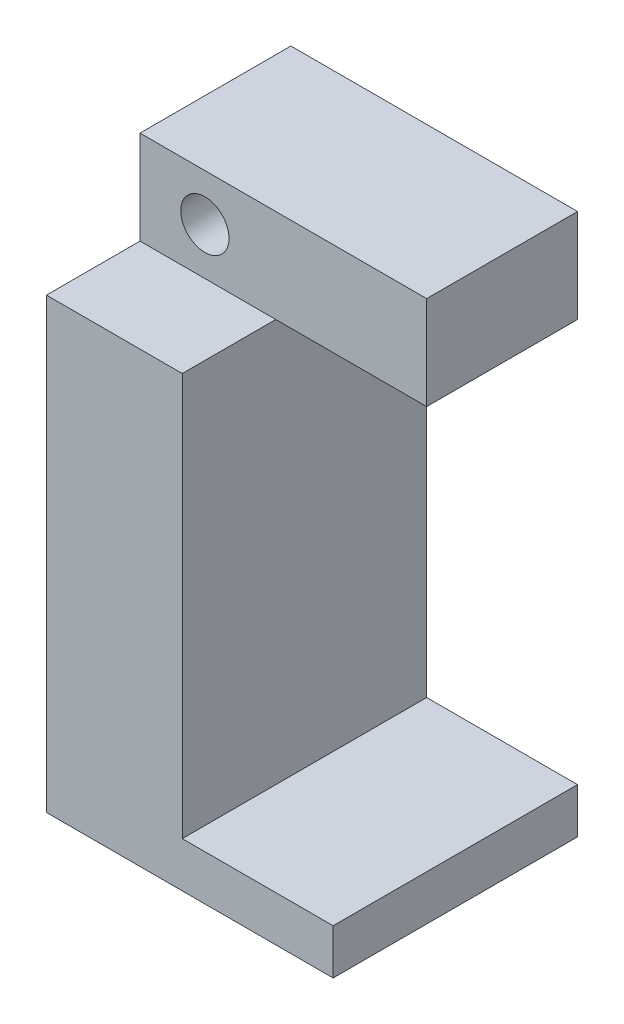
ISO-10303-21;
HEADER;
FILE_DESCRIPTION(('STEP AP214'),'2;1');
FILE_NAME('part.step','',(''),(''),'','','');
FILE_SCHEMA(('AUTOMOTIVE_DESIGN { 1 0 10303 214 1 1 1 1 }'));
ENDSEC;
DATA;
#1=APPLICATION_CONTEXT('core data for automotive mechanical design processes');
#2=APPLICATION_PROTOCOL_DEFINITION('international standard','automotive_design',2000,#1);
#3=PRODUCT_CONTEXT('',#1,'mechanical');
#4=PRODUCT('Part','Part','',(#3));
#5=PRODUCT_RELATED_PRODUCT_CATEGORY('part','',(#4));
#6=PRODUCT_DEFINITION_FORMATION('','',#4);
#7=PRODUCT_DEFINITION_CONTEXT('part definition',#1,'design');
#8=PRODUCT_DEFINITION('design','',#6,#7);
#9=PRODUCT_DEFINITION_SHAPE('','',#8);
#10=(LENGTH_UNIT() NAMED_UNIT(*) SI_UNIT(.MILLI.,.METRE.));
#11=(NAMED_UNIT(*) PLANE_ANGLE_UNIT() SI_UNIT($,.RADIAN.));
#12=(NAMED_UNIT(*) SI_UNIT($,.STERADIAN.) SOLID_ANGLE_UNIT());
#13=UNCERTAINTY_MEASURE_WITH_UNIT(LENGTH_MEASURE(1.E-05),#10,'distance_accuracy_value','');
#14=(GEOMETRIC_REPRESENTATION_CONTEXT(3) GLOBAL_UNCERTAINTY_ASSIGNED_CONTEXT((#13)) GLOBAL_UNIT_ASSIGNED_CONTEXT((#10,
#11,#12)) REPRESENTATION_CONTEXT('',''));
#15=CARTESIAN_POINT('',(0.,0.,0.));
#16=DIRECTION('',(0.,0.,1.));
#17=DIRECTION('',(1.,0.,0.));
#18=AXIS2_PLACEMENT_3D('',#15,#16,#17);
#19=CARTESIAN_POINT('',(4.29999999999999,32.8,-0.000999999999999265));
#20=DIRECTION('',(0.,0.,1.));
#21=DIRECTION('',(1.,0.,0.));
#22=AXIS2_PLACEMENT_3D('',#19,#20,#21);
#23=CYLINDRICAL_SURFACE('',#22,1.6);
#24=CARTESIAN_POINT('',(4.29999999999999,32.8,10.));
#25=DIRECTION('',(0.,0.,1.));
#26=DIRECTION('',(1.,0.,0.));
#27=AXIS2_PLACEMENT_3D('',#24,#25,#26);
#28=CIRCLE('',#27,1.6);
#29=CARTESIAN_POINT('',(5.89999999999999,32.8,10.));
#30=VERTEX_POINT('',#29);
#31=EDGE_CURVE('E206',#30,#30,#28,.T.);
#32=ORIENTED_EDGE('',*,*,#31,.T.);
#33=EDGE_LOOP('',(#32));
#34=FACE_BOUND('',#33,.T.);
#35=CARTESIAN_POINT('',(4.29999999999999,32.8,3.));
#36=DIRECTION('',(0.,0.,-1.));
#37=DIRECTION('',(-1.,0.,0.));
#38=AXIS2_PLACEMENT_3D('',#35,#36,#37);
#39=CIRCLE('',#38,1.6);
#40=CARTESIAN_POINT('',(2.69999999999999,32.8,3.));
#41=VERTEX_POINT('',#40);
#42=EDGE_CURVE('E35',#41,#41,#39,.F.);
#43=ORIENTED_EDGE('',*,*,#42,.F.);
#44=EDGE_LOOP('',(#43));
#45=FACE_BOUND('',#44,.T.);
#46=ADVANCED_FACE('F31',(#34,#45),#23,.F.);
#47=CARTESIAN_POINT('',(0.,35.9,10.));
#48=DIRECTION('',(1.,0.,0.));
#49=DIRECTION('',(0.,0.,-1.));
#50=AXIS2_PLACEMENT_3D('',#47,#48,#49);
#51=PLANE('',#50);
#52=DIRECTION('',(0.,-1.,0.));
#53=VECTOR('',#52,1.);
#54=CARTESIAN_POINT('',(0.,35.9,0.));
#55=LINE('',#54,#53);
#56=CARTESIAN_POINT('',(0.,35.9,0.));
#57=VERTEX_POINT('',#56);
#58=CARTESIAN_POINT('',(0.,0.,0.));
#59=VERTEX_POINT('',#58);
#60=EDGE_CURVE('E241',#57,#59,#55,.T.);
#61=ORIENTED_EDGE('',*,*,#60,.T.);
#62=DIRECTION('',(0.,0.,-1.));
#63=VECTOR('',#62,1.);
#64=CARTESIAN_POINT('',(0.,0.,10.));
#65=LINE('',#64,#63);
#66=CARTESIAN_POINT('',(0.,0.,16.2));
#67=VERTEX_POINT('',#66);
#68=EDGE_CURVE('E11',#67,#59,#65,.T.);
#69=ORIENTED_EDGE('',*,*,#68,.F.);
#70=DIRECTION('',(0.,-1.,0.));
#71=VECTOR('',#70,1.);
#72=CARTESIAN_POINT('',(0.,29.7,16.2));
#73=LINE('',#72,#71);
#74=CARTESIAN_POINT('',(0.,29.7,16.2));
#75=VERTEX_POINT('',#74);
#76=EDGE_CURVE('E222',#75,#67,#73,.T.);
#77=ORIENTED_EDGE('',*,*,#76,.F.);
#78=DIRECTION('',(0.,0.,-1.));
#79=VECTOR('',#78,1.);
#80=CARTESIAN_POINT('',(0.,29.7,16.2));
#81=LINE('',#80,#79);
#82=CARTESIAN_POINT('',(0.,29.7,10.));
#83=VERTEX_POINT('',#82);
#84=EDGE_CURVE('E225',#75,#83,#81,.T.);
#85=ORIENTED_EDGE('',*,*,#84,.T.);
#86=DIRECTION('',(0.,-1.,0.));
#87=VECTOR('',#86,1.);
#88=CARTESIAN_POINT('',(0.,35.9,10.));
#89=LINE('',#88,#87);
#90=CARTESIAN_POINT('',(0.,35.9,10.));
#91=VERTEX_POINT('',#90);
#92=EDGE_CURVE('E233',#91,#83,#89,.T.);
#93=ORIENTED_EDGE('',*,*,#92,.F.);
#94=DIRECTION('',(0.,0.,-1.));
#95=VECTOR('',#94,1.);
#96=CARTESIAN_POINT('',(0.,35.9,10.));
#97=LINE('',#96,#95);
#98=EDGE_CURVE('E264',#91,#57,#97,.T.);
#99=ORIENTED_EDGE('',*,*,#98,.T.);
#100=EDGE_LOOP('',(#61,#69,#77,#85,#93,#99));
#101=FACE_BOUND('',#100,.T.);
#102=ADVANCED_FACE('F33',(#101),#51,.F.);
#103=CARTESIAN_POINT('',(0.,0.,10.));
#104=DIRECTION('',(0.,1.,0.));
#105=DIRECTION('',(0.,0.,1.));
#106=AXIS2_PLACEMENT_3D('',#103,#104,#105);
#107=PLANE('',#106);
#108=DIRECTION('',(1.,0.,0.));
#109=VECTOR('',#108,1.);
#110=CARTESIAN_POINT('',(0.,0.,0.));
#111=LINE('',#110,#109);
#112=CARTESIAN_POINT('',(19.,0.,0.));
#113=VERTEX_POINT('',#112);
#114=EDGE_CURVE('E246',#59,#113,#111,.T.);
#115=ORIENTED_EDGE('',*,*,#114,.T.);
#116=DIRECTION('',(0.,0.,-1.));
#117=VECTOR('',#116,1.);
#118=CARTESIAN_POINT('',(19.,0.,10.));
#119=LINE('',#118,#117);
#120=CARTESIAN_POINT('',(19.,0.,16.2));
#121=VERTEX_POINT('',#120);
#122=EDGE_CURVE('E40',#121,#113,#119,.T.);
#123=ORIENTED_EDGE('',*,*,#122,.F.);
#124=DIRECTION('',(1.,0.,0.));
#125=VECTOR('',#124,1.);
#126=CARTESIAN_POINT('',(0.,0.,16.2));
#127=LINE('',#126,#125);
#128=EDGE_CURVE('E209',#67,#121,#127,.T.);
#129=ORIENTED_EDGE('',*,*,#128,.F.);
#130=ORIENTED_EDGE('',*,*,#68,.T.);
#131=EDGE_LOOP('',(#115,#123,#129,#130));
#132=FACE_BOUND('',#131,.T.);
#133=ADVANCED_FACE('F300',(#132),#107,.F.);
#134=CARTESIAN_POINT('',(19.,0.,10.));
#135=DIRECTION('',(-1.,0.,0.));
#136=DIRECTION('',(0.,0.,1.));
#137=AXIS2_PLACEMENT_3D('',#134,#135,#136);
#138=PLANE('',#137);
#139=DIRECTION('',(0.,1.,0.));
#140=VECTOR('',#139,1.);
#141=CARTESIAN_POINT('',(19.,0.,0.));
#142=LINE('',#141,#140);
#143=CARTESIAN_POINT('',(19.,3.,0.));
#144=VERTEX_POINT('',#143);
#145=EDGE_CURVE('E249',#113,#144,#142,.T.);
#146=ORIENTED_EDGE('',*,*,#145,.T.);
#147=DIRECTION('',(0.,0.,-1.));
#148=VECTOR('',#147,1.);
#149=CARTESIAN_POINT('',(19.,3.,10.));
#150=LINE('',#149,#148);
#151=CARTESIAN_POINT('',(19.,3.,16.2));
#152=VERTEX_POINT('',#151);
#153=EDGE_CURVE('E277',#152,#144,#150,.T.);
#154=ORIENTED_EDGE('',*,*,#153,.F.);
#155=DIRECTION('',(0.,1.,0.));
#156=VECTOR('',#155,1.);
#157=CARTESIAN_POINT('',(19.,0.,16.2));
#158=LINE('',#157,#156);
#159=EDGE_CURVE('E212',#121,#152,#158,.T.);
#160=ORIENTED_EDGE('',*,*,#159,.F.);
#161=ORIENTED_EDGE('',*,*,#122,.T.);
#162=EDGE_LOOP('',(#146,#154,#160,#161));
#163=FACE_BOUND('',#162,.T.);
#164=ADVANCED_FACE('F284',(#163),#138,.F.);
#165=CARTESIAN_POINT('',(19.,3.,10.));
#166=DIRECTION('',(0.,-1.,0.));
#167=DIRECTION('',(1.,0.,0.));
#168=AXIS2_PLACEMENT_3D('',#165,#166,#167);
#169=PLANE('',#168);
#170=DIRECTION('',(-1.,0.,0.));
#171=VECTOR('',#170,1.);
#172=CARTESIAN_POINT('',(19.,3.,0.));
#173=LINE('',#172,#171);
#174=CARTESIAN_POINT('',(9.,2.99999999999999,0.));
#175=VERTEX_POINT('',#174);
#176=EDGE_CURVE('E255',#144,#175,#173,.T.);
#177=ORIENTED_EDGE('',*,*,#176,.T.);
#178=DIRECTION('',(0.,0.,-1.));
#179=VECTOR('',#178,1.);
#180=CARTESIAN_POINT('',(9.,2.99999999999999,10.));
#181=LINE('',#180,#179);
#182=CARTESIAN_POINT('',(9.,2.99999999999999,16.2));
#183=VERTEX_POINT('',#182);
#184=EDGE_CURVE('E274',#183,#175,#181,.T.);
#185=ORIENTED_EDGE('',*,*,#184,.F.);
#186=DIRECTION('',(-1.,0.,0.));
#187=VECTOR('',#186,1.);
#188=CARTESIAN_POINT('',(19.,3.,16.2));
#189=LINE('',#188,#187);
#190=EDGE_CURVE('E215',#152,#183,#189,.T.);
#191=ORIENTED_EDGE('',*,*,#190,.F.);
#192=ORIENTED_EDGE('',*,*,#153,.T.);
#193=EDGE_LOOP('',(#177,#185,#191,#192));
#194=FACE_BOUND('',#193,.T.);
#195=ADVANCED_FACE('F293',(#194),#169,.F.);
#196=CARTESIAN_POINT('',(9.,2.99999999999999,10.));
#197=DIRECTION('',(-1.,0.,0.));
#198=DIRECTION('',(0.,-1.,0.));
#199=AXIS2_PLACEMENT_3D('',#196,#197,#198);
#200=PLANE('',#199);
#201=DIRECTION('',(0.,1.,0.));
#202=VECTOR('',#201,1.);
#203=CARTESIAN_POINT('',(9.,2.99999999999999,0.));
#204=LINE('',#203,#202);
#205=CARTESIAN_POINT('',(8.99999999999999,29.7,0.));
#206=VERTEX_POINT('',#205);
#207=EDGE_CURVE('E257',#175,#206,#204,.T.);
#208=ORIENTED_EDGE('',*,*,#207,.T.);
#209=DIRECTION('',(0.,0.,-1.));
#210=VECTOR('',#209,1.);
#211=CARTESIAN_POINT('',(8.99999999999999,29.7,10.));
#212=LINE('',#211,#210);
#213=CARTESIAN_POINT('',(8.99999999999999,29.7,10.));
#214=VERTEX_POINT('',#213);
#215=EDGE_CURVE('E271',#214,#206,#212,.T.);
#216=ORIENTED_EDGE('',*,*,#215,.F.);
#217=DIRECTION('',(0.,0.,-1.));
#218=VECTOR('',#217,1.);
#219=CARTESIAN_POINT('',(8.99999999999999,29.7,16.2));
#220=LINE('',#219,#218);
#221=CARTESIAN_POINT('',(8.99999999999999,29.7,16.2));
#222=VERTEX_POINT('',#221);
#223=EDGE_CURVE('E228',#222,#214,#220,.T.);
#224=ORIENTED_EDGE('',*,*,#223,.F.);
#225=DIRECTION('',(0.,1.,0.));
#226=VECTOR('',#225,1.);
#227=CARTESIAN_POINT('',(9.,2.99999999999999,16.2));
#228=LINE('',#227,#226);
#229=EDGE_CURVE('E218',#183,#222,#228,.T.);
#230=ORIENTED_EDGE('',*,*,#229,.F.);
#231=ORIENTED_EDGE('',*,*,#184,.T.);
#232=EDGE_LOOP('',(#208,#216,#224,#230,#231));
#233=FACE_BOUND('',#232,.T.);
#234=ADVANCED_FACE('F297',(#233),#200,.F.);
#235=CARTESIAN_POINT('',(8.99999999999999,29.7,10.));
#236=DIRECTION('',(0.,1.,0.));
#237=DIRECTION('',(0.,0.,1.));
#238=AXIS2_PLACEMENT_3D('',#235,#236,#237);
#239=PLANE('',#238);
#240=DIRECTION('',(1.,0.,0.));
#241=VECTOR('',#240,1.);
#242=CARTESIAN_POINT('',(8.99999999999999,29.7,0.));
#243=LINE('',#242,#241);
#244=CARTESIAN_POINT('',(19.,29.7,0.));
#245=VERTEX_POINT('',#244);
#246=EDGE_CURVE('E259',#206,#245,#243,.T.);
#247=ORIENTED_EDGE('',*,*,#246,.T.);
#248=DIRECTION('',(0.,0.,-1.));
#249=VECTOR('',#248,1.);
#250=CARTESIAN_POINT('',(19.,29.7,10.));
#251=LINE('',#250,#249);
#252=CARTESIAN_POINT('',(19.,29.7,10.));
#253=VERTEX_POINT('',#252);
#254=EDGE_CURVE('E268',#253,#245,#251,.T.);
#255=ORIENTED_EDGE('',*,*,#254,.F.);
#256=DIRECTION('',(1.,0.,0.));
#257=VECTOR('',#256,1.);
#258=CARTESIAN_POINT('',(8.99999999999999,29.7,10.));
#259=LINE('',#258,#257);
#260=EDGE_CURVE('E505',#214,#253,#259,.T.);
#261=ORIENTED_EDGE('',*,*,#260,.F.);
#262=ORIENTED_EDGE('',*,*,#215,.T.);
#263=EDGE_LOOP('',(#247,#255,#261,#262));
#264=FACE_BOUND('',#263,.T.);
#265=ADVANCED_FACE('F332',(#264),#239,.F.);
#266=CARTESIAN_POINT('',(19.,29.7,10.));
#267=DIRECTION('',(-1.,0.,0.));
#268=DIRECTION('',(0.,-1.,0.));
#269=AXIS2_PLACEMENT_3D('',#266,#267,#268);
#270=PLANE('',#269);
#271=DIRECTION('',(0.,1.,0.));
#272=VECTOR('',#271,1.);
#273=CARTESIAN_POINT('',(19.,29.7,0.));
#274=LINE('',#273,#272);
#275=CARTESIAN_POINT('',(19.,35.9,0.));
#276=VERTEX_POINT('',#275);
#277=EDGE_CURVE('E261',#245,#276,#274,.T.);
#278=ORIENTED_EDGE('',*,*,#277,.T.);
#279=DIRECTION('',(0.,0.,-1.));
#280=VECTOR('',#279,1.);
#281=CARTESIAN_POINT('',(19.,35.9,10.));
#282=LINE('',#281,#280);
#283=CARTESIAN_POINT('',(19.,35.9,10.));
#284=VERTEX_POINT('',#283);
#285=EDGE_CURVE('E266',#284,#276,#282,.T.);
#286=ORIENTED_EDGE('',*,*,#285,.F.);
#287=DIRECTION('',(0.,1.,0.));
#288=VECTOR('',#287,1.);
#289=CARTESIAN_POINT('',(19.,29.7,10.));
#290=LINE('',#289,#288);
#291=EDGE_CURVE('E504',#253,#284,#290,.T.);
#292=ORIENTED_EDGE('',*,*,#291,.F.);
#293=ORIENTED_EDGE('',*,*,#254,.T.);
#294=EDGE_LOOP('',(#278,#286,#292,#293));
#295=FACE_BOUND('',#294,.T.);
#296=ADVANCED_FACE('F329',(#295),#270,.F.);
#297=CARTESIAN_POINT('',(19.,35.9,10.));
#298=DIRECTION('',(0.,-1.,0.));
#299=DIRECTION('',(0.,0.,-1.));
#300=AXIS2_PLACEMENT_3D('',#297,#298,#299);
#301=PLANE('',#300);
#302=DIRECTION('',(-1.,0.,0.));
#303=VECTOR('',#302,1.);
#304=CARTESIAN_POINT('',(19.,35.9,0.));
#305=LINE('',#304,#303);
#306=EDGE_CURVE('E90',#276,#57,#305,.T.);
#307=ORIENTED_EDGE('',*,*,#306,.T.);
#308=ORIENTED_EDGE('',*,*,#98,.F.);
#309=DIRECTION('',(-1.,0.,0.));
#310=VECTOR('',#309,1.);
#311=CARTESIAN_POINT('',(19.,35.9,10.));
#312=LINE('',#311,#310);
#313=EDGE_CURVE('E57',#284,#91,#312,.T.);
#314=ORIENTED_EDGE('',*,*,#313,.F.);
#315=ORIENTED_EDGE('',*,*,#285,.T.);
#316=EDGE_LOOP('',(#307,#308,#314,#315));
#317=FACE_BOUND('',#316,.T.);
#318=ADVANCED_FACE('F322',(#317),#301,.F.);
#319=CARTESIAN_POINT('',(0.,0.,10.));
#320=DIRECTION('',(0.,0.,1.));
#321=DIRECTION('',(1.,0.,0.));
#322=AXIS2_PLACEMENT_3D('',#319,#320,#321);
#323=PLANE('',#322);
#324=ORIENTED_EDGE('',*,*,#31,.F.);
#325=EDGE_LOOP('',(#324));
#326=FACE_BOUND('',#325,.T.);
#327=DIRECTION('',(-1.,0.,0.));
#328=VECTOR('',#327,1.);
#329=CARTESIAN_POINT('',(8.99999999999999,29.7,10.));
#330=LINE('',#329,#328);
#331=EDGE_CURVE('E96',#214,#83,#330,.T.);
#332=ORIENTED_EDGE('',*,*,#331,.F.);
#333=ORIENTED_EDGE('',*,*,#260,.T.);
#334=ORIENTED_EDGE('',*,*,#291,.T.);
#335=ORIENTED_EDGE('',*,*,#313,.T.);
#336=ORIENTED_EDGE('',*,*,#92,.T.);
#337=EDGE_LOOP('',(#332,#333,#334,#335,#336));
#338=FACE_BOUND('',#337,.T.);
#339=ADVANCED_FACE('F319',(#326,#338),#323,.T.);
#340=CARTESIAN_POINT('',(0.,0.,0.));
#341=DIRECTION('',(0.,0.,1.));
#342=DIRECTION('',(1.,0.,0.));
#343=AXIS2_PLACEMENT_3D('',#340,#341,#342);
#344=PLANE('',#343);
#345=DIRECTION('',(1.,0.,0.));
#346=VECTOR('',#345,1.);
#347=CARTESIAN_POINT('',(2.65455173280956,35.65,0.));
#348=LINE('',#347,#346);
#349=CARTESIAN_POINT('',(2.65455173280956,35.65,0.));
#350=VERTEX_POINT('',#349);
#351=CARTESIAN_POINT('',(5.94544826719043,35.65,0.));
#352=VERTEX_POINT('',#351);
#353=EDGE_CURVE('E187',#350,#352,#348,.T.);
#354=ORIENTED_EDGE('',*,*,#353,.F.);
#355=DIRECTION('',(0.5,0.866025403784438,0.));
#356=VECTOR('',#355,1.);
#357=CARTESIAN_POINT('',(1.00910346561912,32.8,0.));
#358=LINE('',#357,#356);
#359=CARTESIAN_POINT('',(1.00910346561912,32.8,0.));
#360=VERTEX_POINT('',#359);
#361=EDGE_CURVE('E48',#360,#350,#358,.T.);
#362=ORIENTED_EDGE('',*,*,#361,.F.);
#363=DIRECTION('',(-0.5,0.866025403784439,0.));
#364=VECTOR('',#363,1.);
#365=CARTESIAN_POINT('',(2.65455173280955,29.95,0.));
#366=LINE('',#365,#364);
#367=CARTESIAN_POINT('',(2.65455173280955,29.95,0.));
#368=VERTEX_POINT('',#367);
#369=EDGE_CURVE('E173',#368,#360,#366,.T.);
#370=ORIENTED_EDGE('',*,*,#369,.F.);
#371=DIRECTION('',(-1.,0.,0.));
#372=VECTOR('',#371,1.);
#373=CARTESIAN_POINT('',(5.94544826719043,29.95,0.));
#374=LINE('',#373,#372);
#375=CARTESIAN_POINT('',(5.94544826719043,29.95,0.));
#376=VERTEX_POINT('',#375);
#377=EDGE_CURVE('E176',#376,#368,#374,.T.);
#378=ORIENTED_EDGE('',*,*,#377,.F.);
#379=DIRECTION('',(-0.5,-0.866025403784438,0.));
#380=VECTOR('',#379,1.);
#381=CARTESIAN_POINT('',(7.59089653438087,32.8,0.));
#382=LINE('',#381,#380);
#383=CARTESIAN_POINT('',(7.59089653438087,32.8,0.));
#384=VERTEX_POINT('',#383);
#385=EDGE_CURVE('E192',#384,#376,#382,.T.);
#386=ORIENTED_EDGE('',*,*,#385,.F.);
#387=DIRECTION('',(0.5,-0.866025403784439,0.));
#388=VECTOR('',#387,1.);
#389=CARTESIAN_POINT('',(5.94544826719043,35.65,0.));
#390=LINE('',#389,#388);
#391=EDGE_CURVE('E189',#352,#384,#390,.T.);
#392=ORIENTED_EDGE('',*,*,#391,.F.);
#393=EDGE_LOOP('',(#354,#362,#370,#378,#386,#392));
#394=FACE_BOUND('',#393,.T.);
#395=ORIENTED_EDGE('',*,*,#60,.F.);
#396=ORIENTED_EDGE('',*,*,#306,.F.);
#397=ORIENTED_EDGE('',*,*,#277,.F.);
#398=ORIENTED_EDGE('',*,*,#246,.F.);
#399=ORIENTED_EDGE('',*,*,#207,.F.);
#400=ORIENTED_EDGE('',*,*,#176,.F.);
#401=ORIENTED_EDGE('',*,*,#145,.F.);
#402=ORIENTED_EDGE('',*,*,#114,.F.);
#403=EDGE_LOOP('',(#395,#396,#397,#398,#399,#400,#401,#402));
#404=FACE_BOUND('',#403,.T.);
#405=ADVANCED_FACE('F289',(#394,#404),#344,.F.);
#406=CARTESIAN_POINT('',(8.99999999999999,29.7,16.2));
#407=DIRECTION('',(0.,-1.,0.));
#408=DIRECTION('',(0.,0.,-1.));
#409=AXIS2_PLACEMENT_3D('',#406,#407,#408);
#410=PLANE('',#409);
#411=ORIENTED_EDGE('',*,*,#331,.T.);
#412=ORIENTED_EDGE('',*,*,#84,.F.);
#413=DIRECTION('',(-1.,0.,0.));
#414=VECTOR('',#413,1.);
#415=CARTESIAN_POINT('',(8.99999999999999,29.7,16.2));
#416=LINE('',#415,#414);
#417=EDGE_CURVE('E220',#222,#75,#416,.T.);
#418=ORIENTED_EDGE('',*,*,#417,.F.);
#419=ORIENTED_EDGE('',*,*,#223,.T.);
#420=EDGE_LOOP('',(#411,#412,#418,#419));
#421=FACE_BOUND('',#420,.T.);
#422=ADVANCED_FACE('F316',(#421),#410,.F.);
#423=CARTESIAN_POINT('',(19.,0.,16.2));
#424=DIRECTION('',(0.,0.,1.));
#425=DIRECTION('',(1.,0.,0.));
#426=AXIS2_PLACEMENT_3D('',#423,#424,#425);
#427=PLANE('',#426);
#428=ORIENTED_EDGE('',*,*,#128,.T.);
#429=ORIENTED_EDGE('',*,*,#159,.T.);
#430=ORIENTED_EDGE('',*,*,#190,.T.);
#431=ORIENTED_EDGE('',*,*,#229,.T.);
#432=ORIENTED_EDGE('',*,*,#417,.T.);
#433=ORIENTED_EDGE('',*,*,#76,.T.);
#434=EDGE_LOOP('',(#428,#429,#430,#431,#432,#433));
#435=FACE_BOUND('',#434,.T.);
#436=ADVANCED_FACE('F299',(#435),#427,.T.);
#437=CARTESIAN_POINT('',(2.65455173280956,35.65,3.));
#438=DIRECTION('',(0.,0.,-1.));
#439=DIRECTION('',(-1.,0.,0.));
#440=AXIS2_PLACEMENT_3D('',#437,#438,#439);
#441=PLANE('',#440);
#442=DIRECTION('',(0.5,0.866025403784438,0.));
#443=VECTOR('',#442,1.);
#444=CARTESIAN_POINT('',(1.00910346561912,32.8,3.));
#445=LINE('',#444,#443);
#446=CARTESIAN_POINT('',(1.00910346561912,32.8,3.));
#447=VERTEX_POINT('',#446);
#448=CARTESIAN_POINT('',(2.65455173280956,35.65,3.));
#449=VERTEX_POINT('',#448);
#450=EDGE_CURVE('E153',#447,#449,#445,.T.);
#451=ORIENTED_EDGE('',*,*,#450,.T.);
#452=DIRECTION('',(1.,0.,0.));
#453=VECTOR('',#452,1.);
#454=CARTESIAN_POINT('',(2.65455173280956,35.65,3.));
#455=LINE('',#454,#453);
#456=CARTESIAN_POINT('',(5.94544826719043,35.65,3.));
#457=VERTEX_POINT('',#456);
#458=EDGE_CURVE('E162',#449,#457,#455,.T.);
#459=ORIENTED_EDGE('',*,*,#458,.T.);
#460=DIRECTION('',(0.5,-0.866025403784439,0.));
#461=VECTOR('',#460,1.);
#462=CARTESIAN_POINT('',(5.94544826719043,35.65,3.));
#463=LINE('',#462,#461);
#464=CARTESIAN_POINT('',(7.59089653438087,32.8,3.));
#465=VERTEX_POINT('',#464);
#466=EDGE_CURVE('E167',#457,#465,#463,.T.);
#467=ORIENTED_EDGE('',*,*,#466,.T.);
#468=DIRECTION('',(-0.5,-0.866025403784438,0.));
#469=VECTOR('',#468,1.);
#470=CARTESIAN_POINT('',(7.59089653438087,32.8,3.));
#471=LINE('',#470,#469);
#472=CARTESIAN_POINT('',(5.94544826719043,29.95,3.));
#473=VERTEX_POINT('',#472);
#474=EDGE_CURVE('E180',#465,#473,#471,.T.);
#475=ORIENTED_EDGE('',*,*,#474,.T.);
#476=DIRECTION('',(-1.,0.,0.));
#477=VECTOR('',#476,1.);
#478=CARTESIAN_POINT('',(5.94544826719043,29.95,3.));
#479=LINE('',#478,#477);
#480=CARTESIAN_POINT('',(2.65455173280955,29.95,3.));
#481=VERTEX_POINT('',#480);
#482=EDGE_CURVE('E183',#473,#481,#479,.T.);
#483=ORIENTED_EDGE('',*,*,#482,.T.);
#484=DIRECTION('',(-0.5,0.866025403784439,0.));
#485=VECTOR('',#484,1.);
#486=CARTESIAN_POINT('',(2.65455173280955,29.95,3.));
#487=LINE('',#486,#485);
#488=EDGE_CURVE('E159',#481,#447,#487,.T.);
#489=ORIENTED_EDGE('',*,*,#488,.T.);
#490=EDGE_LOOP('',(#451,#459,#467,#475,#483,#489));
#491=FACE_BOUND('',#490,.T.);
#492=ORIENTED_EDGE('',*,*,#42,.T.);
#493=EDGE_LOOP('',(#492));
#494=FACE_BOUND('',#493,.T.);
#495=ADVANCED_FACE('F169',(#491,#494),#441,.T.);
#496=CARTESIAN_POINT('',(1.00910346561912,32.8,3.));
#497=DIRECTION('',(-0.866025403784439,0.5,0.));
#498=DIRECTION('',(-0.5,-0.866025403784439,0.));
#499=AXIS2_PLACEMENT_3D('',#496,#497,#498);
#500=PLANE('',#499);
#501=ORIENTED_EDGE('',*,*,#361,.T.);
#502=DIRECTION('',(0.,0.,-1.));
#503=VECTOR('',#502,1.);
#504=CARTESIAN_POINT('',(2.65455173280956,35.65,3.));
#505=LINE('',#504,#503);
#506=EDGE_CURVE('E149',#449,#350,#505,.T.);
#507=ORIENTED_EDGE('',*,*,#506,.F.);
#508=ORIENTED_EDGE('',*,*,#450,.F.);
#509=DIRECTION('',(0.,0.,-1.));
#510=VECTOR('',#509,1.);
#511=CARTESIAN_POINT('',(1.00910346561912,32.8,3.));
#512=LINE('',#511,#510);
#513=EDGE_CURVE('E197',#447,#360,#512,.T.);
#514=ORIENTED_EDGE('',*,*,#513,.T.);
#515=EDGE_LOOP('',(#501,#507,#508,#514));
#516=FACE_BOUND('',#515,.T.);
#517=ADVANCED_FACE('F151',(#516),#500,.F.);
#518=CARTESIAN_POINT('',(2.65455173280955,29.95,3.));
#519=DIRECTION('',(-0.866025403784439,-0.5,0.));
#520=DIRECTION('',(0.5,-0.866025403784439,0.));
#521=AXIS2_PLACEMENT_3D('',#518,#519,#520);
#522=PLANE('',#521);
#523=ORIENTED_EDGE('',*,*,#369,.T.);
#524=ORIENTED_EDGE('',*,*,#513,.F.);
#525=ORIENTED_EDGE('',*,*,#488,.F.);
#526=DIRECTION('',(0.,0.,-1.));
#527=VECTOR('',#526,1.);
#528=CARTESIAN_POINT('',(2.65455173280955,29.95,3.));
#529=LINE('',#528,#527);
#530=EDGE_CURVE('E199',#481,#368,#529,.T.);
#531=ORIENTED_EDGE('',*,*,#530,.T.);
#532=EDGE_LOOP('',(#523,#524,#525,#531));
#533=FACE_BOUND('',#532,.T.);
#534=ADVANCED_FACE('F394',(#533),#522,.F.);
#535=CARTESIAN_POINT('',(5.94544826719043,29.95,3.));
#536=DIRECTION('',(0.,-1.,0.));
#537=DIRECTION('',(0.,0.,-1.));
#538=AXIS2_PLACEMENT_3D('',#535,#536,#537);
#539=PLANE('',#538);
#540=ORIENTED_EDGE('',*,*,#377,.T.);
#541=ORIENTED_EDGE('',*,*,#530,.F.);
#542=ORIENTED_EDGE('',*,*,#482,.F.);
#543=DIRECTION('',(0.,0.,-1.));
#544=VECTOR('',#543,1.);
#545=CARTESIAN_POINT('',(5.94544826719043,29.95,3.));
#546=LINE('',#545,#544);
#547=EDGE_CURVE('E201',#473,#376,#546,.T.);
#548=ORIENTED_EDGE('',*,*,#547,.T.);
#549=EDGE_LOOP('',(#540,#541,#542,#548));
#550=FACE_BOUND('',#549,.T.);
#551=ADVANCED_FACE('F400',(#550),#539,.F.);
#552=CARTESIAN_POINT('',(7.59089653438087,32.8,3.));
#553=DIRECTION('',(0.866025403784438,-0.500000000000001,0.));
#554=DIRECTION('',(0.500000000000001,0.866025403784438,0.));
#555=AXIS2_PLACEMENT_3D('',#552,#553,#554);
#556=PLANE('',#555);
#557=ORIENTED_EDGE('',*,*,#385,.T.);
#558=ORIENTED_EDGE('',*,*,#547,.F.);
#559=ORIENTED_EDGE('',*,*,#474,.F.);
#560=DIRECTION('',(0.,0.,-1.));
#561=VECTOR('',#560,1.);
#562=CARTESIAN_POINT('',(7.59089653438087,32.8,3.));
#563=LINE('',#562,#561);
#564=EDGE_CURVE('E203',#465,#384,#563,.T.);
#565=ORIENTED_EDGE('',*,*,#564,.T.);
#566=EDGE_LOOP('',(#557,#558,#559,#565));
#567=FACE_BOUND('',#566,.T.);
#568=ADVANCED_FACE('F408',(#567),#556,.F.);
#569=CARTESIAN_POINT('',(5.94544826719043,35.65,3.));
#570=DIRECTION('',(0.866025403784439,0.5,0.));
#571=DIRECTION('',(-0.5,0.866025403784439,0.));
#572=AXIS2_PLACEMENT_3D('',#569,#570,#571);
#573=PLANE('',#572);
#574=ORIENTED_EDGE('',*,*,#391,.T.);
#575=ORIENTED_EDGE('',*,*,#564,.F.);
#576=ORIENTED_EDGE('',*,*,#466,.F.);
#577=DIRECTION('',(0.,0.,-1.));
#578=VECTOR('',#577,1.);
#579=CARTESIAN_POINT('',(5.94544826719043,35.65,3.));
#580=LINE('',#579,#578);
#581=EDGE_CURVE('E158',#457,#352,#580,.T.);
#582=ORIENTED_EDGE('',*,*,#581,.T.);
#583=EDGE_LOOP('',(#574,#575,#576,#582));
#584=FACE_BOUND('',#583,.T.);
#585=ADVANCED_FACE('F416',(#584),#573,.F.);
#586=CARTESIAN_POINT('',(2.65455173280956,35.65,3.));
#587=DIRECTION('',(0.,1.,0.));
#588=DIRECTION('',(0.,0.,1.));
#589=AXIS2_PLACEMENT_3D('',#586,#587,#588);
#590=PLANE('',#589);
#591=ORIENTED_EDGE('',*,*,#353,.T.);
#592=ORIENTED_EDGE('',*,*,#581,.F.);
#593=ORIENTED_EDGE('',*,*,#458,.F.);
#594=ORIENTED_EDGE('',*,*,#506,.T.);
#595=EDGE_LOOP('',(#591,#592,#593,#594));
#596=FACE_BOUND('',#595,.T.);
#597=ADVANCED_FACE('F163',(#596),#590,.F.);
#598=CLOSED_SHELL('',(#46,#102,#133,#164,#195,#234,#265,#296,#318,#339,#405,#422,#436,#495,#517,
#534,#551,#568,#585,#597));
#599=MANIFOLD_SOLID_BREP('B2',#598);
#600=ADVANCED_BREP_SHAPE_REPRESENTATION('',(#18,#599),#14);
#601=SHAPE_DEFINITION_REPRESENTATION(#9,#600);
ENDSEC;
END-ISO-10303-21;
